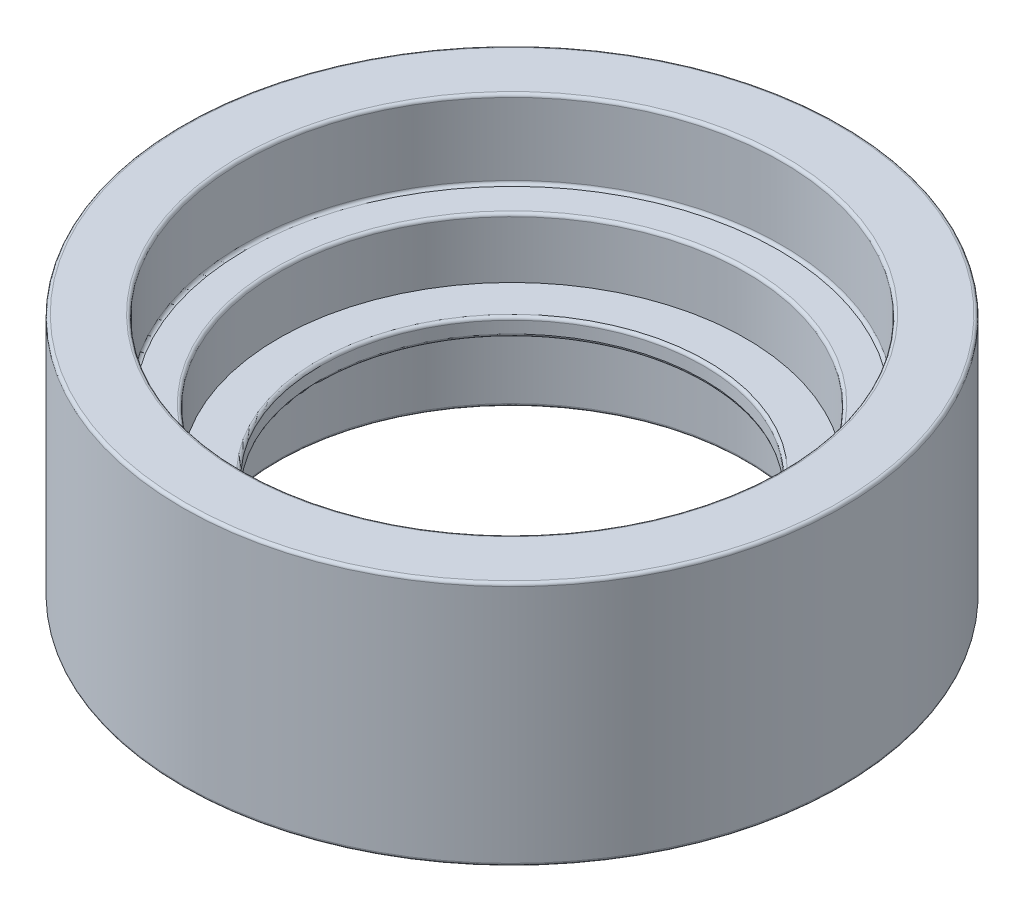
ISO-10303-21;
HEADER;
FILE_DESCRIPTION(('STEP AP214'),'2;1');
FILE_NAME('part.step','',(''),(''),'','','');
FILE_SCHEMA(('AUTOMOTIVE_DESIGN { 1 0 10303 214 1 1 1 1 }'));
ENDSEC;
DATA;
#1=APPLICATION_CONTEXT('core data for automotive mechanical design processes');
#2=APPLICATION_PROTOCOL_DEFINITION('international standard','automotive_design',2000,#1);
#3=PRODUCT_CONTEXT('',#1,'mechanical');
#4=PRODUCT('Part','Part','',(#3));
#5=PRODUCT_RELATED_PRODUCT_CATEGORY('part','',(#4));
#6=PRODUCT_DEFINITION_FORMATION('','',#4);
#7=PRODUCT_DEFINITION_CONTEXT('part definition',#1,'design');
#8=PRODUCT_DEFINITION('design','',#6,#7);
#9=PRODUCT_DEFINITION_SHAPE('','',#8);
#10=(LENGTH_UNIT() NAMED_UNIT(*) SI_UNIT(.MILLI.,.METRE.));
#11=(NAMED_UNIT(*) PLANE_ANGLE_UNIT() SI_UNIT($,.RADIAN.));
#12=(NAMED_UNIT(*) SI_UNIT($,.STERADIAN.) SOLID_ANGLE_UNIT());
#13=UNCERTAINTY_MEASURE_WITH_UNIT(LENGTH_MEASURE(1.E-05),#10,'distance_accuracy_value','');
#14=(GEOMETRIC_REPRESENTATION_CONTEXT(3) GLOBAL_UNCERTAINTY_ASSIGNED_CONTEXT((#13)) GLOBAL_UNIT_ASSIGNED_CONTEXT((#10,
#11,#12)) REPRESENTATION_CONTEXT('',''));
#15=CARTESIAN_POINT('',(0.,0.,0.));
#16=DIRECTION('',(0.,0.,1.));
#17=DIRECTION('',(1.,0.,0.));
#18=AXIS2_PLACEMENT_3D('',#15,#16,#17);
#19=CARTESIAN_POINT('',(0.,-1.5,0.));
#20=DIRECTION('',(0.,1.,0.));
#21=DIRECTION('',(0.,0.,1.));
#22=AXIS2_PLACEMENT_3D('',#19,#20,#21);
#23=CYLINDRICAL_SURFACE('',#22,32.);
#24=CARTESIAN_POINT('',(0.,-1.,0.));
#25=DIRECTION('',(0.,1.,0.));
#26=DIRECTION('',(0.,0.,1.));
#27=AXIS2_PLACEMENT_3D('',#24,#25,#26);
#28=CIRCLE('',#27,32.);
#29=CARTESIAN_POINT('',(0.,-1.,32.));
#30=VERTEX_POINT('',#29);
#31=EDGE_CURVE('E43',#30,#30,#28,.F.);
#32=ORIENTED_EDGE('',*,*,#31,.T.);
#33=EDGE_LOOP('',(#32));
#34=FACE_BOUND('',#33,.T.);
#35=CARTESIAN_POINT('',(0.,1.,0.));
#36=DIRECTION('',(0.,1.,0.));
#37=DIRECTION('',(0.,0.,1.));
#38=AXIS2_PLACEMENT_3D('',#35,#36,#37);
#39=CIRCLE('',#38,32.);
#40=CARTESIAN_POINT('',(0.,1.,32.));
#41=VERTEX_POINT('',#40);
#42=EDGE_CURVE('E47',#41,#41,#39,.T.);
#43=ORIENTED_EDGE('',*,*,#42,.T.);
#44=EDGE_LOOP('',(#43));
#45=FACE_BOUND('',#44,.T.);
#46=ADVANCED_FACE('F36',(#34,#45),#23,.F.);
#47=CARTESIAN_POINT('',(0.,-1.5,0.));
#48=DIRECTION('',(0.,1.,0.));
#49=DIRECTION('',(0.,0.,1.));
#50=AXIS2_PLACEMENT_3D('',#47,#48,#49);
#51=PLANE('',#50);
#52=CARTESIAN_POINT('',(0.,-1.5,0.));
#53=DIRECTION('',(0.,1.,0.));
#54=DIRECTION('',(0.,0.,1.));
#55=AXIS2_PLACEMENT_3D('',#52,#53,#54);
#56=CIRCLE('',#55,32.5);
#57=CARTESIAN_POINT('',(0.,-1.5,32.5));
#58=VERTEX_POINT('',#57);
#59=EDGE_CURVE('E51',#58,#58,#56,.T.);
#60=ORIENTED_EDGE('',*,*,#59,.T.);
#61=EDGE_LOOP('',(#60));
#62=FACE_BOUND('',#61,.T.);
#63=CARTESIAN_POINT('',(0.,-1.5,0.));
#64=DIRECTION('',(0.,1.,0.));
#65=DIRECTION('',(0.,0.,1.));
#66=AXIS2_PLACEMENT_3D('',#63,#64,#65);
#67=CIRCLE('',#66,39.);
#68=CARTESIAN_POINT('',(0.,-1.5,39.));
#69=VERTEX_POINT('',#68);
#70=EDGE_CURVE('E140',#69,#69,#67,.T.);
#71=ORIENTED_EDGE('',*,*,#70,.F.);
#72=EDGE_LOOP('',(#71));
#73=FACE_BOUND('',#72,.T.);
#74=ADVANCED_FACE('F188',(#62,#73),#51,.F.);
#75=CARTESIAN_POINT('',(0.,1.5,0.));
#76=DIRECTION('',(0.,1.,0.));
#77=DIRECTION('',(0.,0.,1.));
#78=AXIS2_PLACEMENT_3D('',#75,#76,#77);
#79=PLANE('',#78);
#80=CARTESIAN_POINT('',(0.,1.5,0.));
#81=DIRECTION('',(0.,1.,0.));
#82=DIRECTION('',(0.,0.,1.));
#83=AXIS2_PLACEMENT_3D('',#80,#81,#82);
#84=CIRCLE('',#83,32.5);
#85=CARTESIAN_POINT('',(0.,1.5,32.5));
#86=VERTEX_POINT('',#85);
#87=EDGE_CURVE('E10',#86,#86,#84,.F.);
#88=ORIENTED_EDGE('',*,*,#87,.T.);
#89=EDGE_LOOP('',(#88));
#90=FACE_BOUND('',#89,.T.);
#91=CARTESIAN_POINT('',(0.,1.5,0.));
#92=DIRECTION('',(0.,1.,0.));
#93=DIRECTION('',(0.,0.,1.));
#94=AXIS2_PLACEMENT_3D('',#91,#92,#93);
#95=CIRCLE('',#94,39.);
#96=CARTESIAN_POINT('',(0.,1.5,39.));
#97=VERTEX_POINT('',#96);
#98=EDGE_CURVE('E143',#97,#97,#95,.T.);
#99=ORIENTED_EDGE('',*,*,#98,.T.);
#100=EDGE_LOOP('',(#99));
#101=FACE_BOUND('',#100,.T.);
#102=ADVANCED_FACE('F193',(#90,#101),#79,.T.);
#103=CARTESIAN_POINT('',(0.,-16.5,0.));
#104=DIRECTION('',(0.,1.,0.));
#105=DIRECTION('',(0.,0.,1.));
#106=AXIS2_PLACEMENT_3D('',#103,#104,#105);
#107=CYLINDRICAL_SURFACE('',#106,39.);
#108=CARTESIAN_POINT('',(0.,-16.,0.));
#109=DIRECTION('',(0.,1.,0.));
#110=DIRECTION('',(0.,0.,1.));
#111=AXIS2_PLACEMENT_3D('',#108,#109,#110);
#112=CIRCLE('',#111,39.);
#113=CARTESIAN_POINT('',(0.,-16.,39.));
#114=VERTEX_POINT('',#113);
#115=EDGE_CURVE('E101',#114,#114,#112,.F.);
#116=ORIENTED_EDGE('',*,*,#115,.T.);
#117=EDGE_LOOP('',(#116));
#118=FACE_BOUND('',#117,.T.);
#119=ORIENTED_EDGE('',*,*,#70,.T.);
#120=EDGE_LOOP('',(#119));
#121=FACE_BOUND('',#120,.T.);
#122=ADVANCED_FACE('F265',(#118,#121),#107,.F.);
#123=CARTESIAN_POINT('',(0.,11.,0.));
#124=DIRECTION('',(0.,1.,0.));
#125=DIRECTION('',(0.,0.,1.));
#126=AXIS2_PLACEMENT_3D('',#123,#124,#125);
#127=CIRCLE('',#126,39.);
#128=CARTESIAN_POINT('',(0.,11.,39.));
#129=VERTEX_POINT('',#128);
#130=EDGE_CURVE('E62',#129,#129,#127,.T.);
#131=ORIENTED_EDGE('',*,*,#130,.T.);
#132=EDGE_LOOP('',(#131));
#133=FACE_BOUND('',#132,.T.);
#134=ORIENTED_EDGE('',*,*,#98,.F.);
#135=EDGE_LOOP('',(#134));
#136=FACE_BOUND('',#135,.T.);
#137=ADVANCED_FACE('F267',(#133,#136),#107,.F.);
#138=CARTESIAN_POINT('',(0.,-16.5,0.));
#139=DIRECTION('',(0.,1.,0.));
#140=DIRECTION('',(0.,0.,1.));
#141=AXIS2_PLACEMENT_3D('',#138,#139,#140);
#142=PLANE('',#141);
#143=CARTESIAN_POINT('',(0.,-16.5,0.));
#144=DIRECTION('',(0.,1.,0.));
#145=DIRECTION('',(0.,0.,1.));
#146=AXIS2_PLACEMENT_3D('',#143,#144,#145);
#147=CIRCLE('',#146,54.5);
#148=CARTESIAN_POINT('',(0.,-16.5,54.5));
#149=VERTEX_POINT('',#148);
#150=EDGE_CURVE('E104',#149,#149,#147,.F.);
#151=ORIENTED_EDGE('',*,*,#150,.T.);
#152=EDGE_LOOP('',(#151));
#153=FACE_BOUND('',#152,.T.);
#154=CARTESIAN_POINT('',(0.,-16.5,0.));
#155=DIRECTION('',(0.,1.,0.));
#156=DIRECTION('',(0.,0.,1.));
#157=AXIS2_PLACEMENT_3D('',#154,#155,#156);
#158=CIRCLE('',#157,39.5);
#159=CARTESIAN_POINT('',(0.,-16.5,39.5));
#160=VERTEX_POINT('',#159);
#161=EDGE_CURVE('E107',#160,#160,#158,.T.);
#162=ORIENTED_EDGE('',*,*,#161,.T.);
#163=EDGE_LOOP('',(#162));
#164=FACE_BOUND('',#163,.T.);
#165=CARTESIAN_POINT('',(-33.2340187157672,-16.5,33.2340187157663));
#166=DIRECTION('',(0.,1.,0.));
#167=DIRECTION('',(0.,0.,1.));
#168=AXIS2_PLACEMENT_3D('',#165,#166,#167);
#169=CIRCLE('',#168,2.50000000000153);
#170=CARTESIAN_POINT('',(-33.2340187157672,-16.5,35.7340187157678));
#171=VERTEX_POINT('',#170);
#172=EDGE_CURVE('E110',#171,#171,#169,.T.);
#173=ORIENTED_EDGE('',*,*,#172,.T.);
#174=EDGE_LOOP('',(#173));
#175=FACE_BOUND('',#174,.T.);
#176=CARTESIAN_POINT('',(-46.999999999998,-16.5,-2.00373051484348E-12));
#177=DIRECTION('',(0.,1.,0.));
#178=DIRECTION('',(0.,0.,1.));
#179=AXIS2_PLACEMENT_3D('',#176,#177,#178);
#180=CIRCLE('',#179,2.50000000000297);
#181=CARTESIAN_POINT('',(-46.999999999998,-16.5,2.50000000000097));
#182=VERTEX_POINT('',#181);
#183=EDGE_CURVE('E113',#182,#182,#180,.T.);
#184=ORIENTED_EDGE('',*,*,#183,.T.);
#185=EDGE_LOOP('',(#184));
#186=FACE_BOUND('',#185,.T.);
#187=CARTESIAN_POINT('',(-33.2340187157643,-16.5,-33.2340187157691));
#188=DIRECTION('',(0.,1.,0.));
#189=DIRECTION('',(0.,0.,1.));
#190=AXIS2_PLACEMENT_3D('',#187,#188,#189);
#191=CIRCLE('',#190,2.50000000000406);
#192=CARTESIAN_POINT('',(-33.2340187157643,-16.5,-30.7340187157651));
#193=VERTEX_POINT('',#192);
#194=EDGE_CURVE('E116',#193,#193,#191,.T.);
#195=ORIENTED_EDGE('',*,*,#194,.T.);
#196=EDGE_LOOP('',(#195));
#197=FACE_BOUND('',#196,.T.);
#198=CARTESIAN_POINT('',(3.99594934977498E-12,-16.5,-47.));
#199=DIRECTION('',(0.,1.,0.));
#200=DIRECTION('',(0.,0.,1.));
#201=AXIS2_PLACEMENT_3D('',#198,#199,#200);
#202=CIRCLE('',#201,2.50000000000414);
#203=CARTESIAN_POINT('',(3.99594934977498E-12,-16.5,-44.4999999999959));
#204=VERTEX_POINT('',#203);
#205=EDGE_CURVE('E119',#204,#204,#202,.T.);
#206=ORIENTED_EDGE('',*,*,#205,.T.);
#207=EDGE_LOOP('',(#206));
#208=FACE_BOUND('',#207,.T.);
#209=CARTESIAN_POINT('',(33.2340187157711,-16.5,-33.2340187157663));
#210=DIRECTION('',(0.,1.,0.));
#211=DIRECTION('',(0.,0.,1.));
#212=AXIS2_PLACEMENT_3D('',#209,#210,#211);
#213=CIRCLE('',#212,2.50000000000307);
#214=CARTESIAN_POINT('',(33.2340187157711,-16.5,-30.7340187157632));
#215=VERTEX_POINT('',#214);
#216=EDGE_CURVE('E122',#215,#215,#213,.T.);
#217=ORIENTED_EDGE('',*,*,#216,.T.);
#218=EDGE_LOOP('',(#217));
#219=FACE_BOUND('',#218,.T.);
#220=CARTESIAN_POINT('',(47.000000000002,-16.5,1.99797467488749E-12));
#221=DIRECTION('',(0.,1.,0.));
#222=DIRECTION('',(0.,0.,1.));
#223=AXIS2_PLACEMENT_3D('',#220,#221,#222);
#224=CIRCLE('',#223,2.50000000000148);
#225=CARTESIAN_POINT('',(47.000000000002,-16.5,2.50000000000348));
#226=VERTEX_POINT('',#225);
#227=EDGE_CURVE('E125',#226,#226,#224,.T.);
#228=ORIENTED_EDGE('',*,*,#227,.T.);
#229=EDGE_LOOP('',(#228));
#230=FACE_BOUND('',#229,.T.);
#231=CARTESIAN_POINT('',(33.2340187157683,-16.5,33.2340187157691));
#232=DIRECTION('',(0.,1.,0.));
#233=DIRECTION('',(0.,0.,1.));
#234=AXIS2_PLACEMENT_3D('',#231,#232,#233);
#235=CIRCLE('',#234,2.50000000000022);
#236=CARTESIAN_POINT('',(33.2340187157683,-16.5,35.7340187157694));
#237=VERTEX_POINT('',#236);
#238=EDGE_CURVE('E128',#237,#237,#235,.T.);
#239=ORIENTED_EDGE('',*,*,#238,.T.);
#240=EDGE_LOOP('',(#239));
#241=FACE_BOUND('',#240,.T.);
#242=CARTESIAN_POINT('',(0.,-16.5,47.));
#243=DIRECTION('',(0.,1.,0.));
#244=DIRECTION('',(0.,0.,1.));
#245=AXIS2_PLACEMENT_3D('',#242,#243,#244);
#246=CIRCLE('',#245,2.5);
#247=CARTESIAN_POINT('',(0.,-16.5,49.5));
#248=VERTEX_POINT('',#247);
#249=EDGE_CURVE('E131',#248,#248,#246,.T.);
#250=ORIENTED_EDGE('',*,*,#249,.T.);
#251=EDGE_LOOP('',(#250));
#252=FACE_BOUND('',#251,.T.);
#253=ADVANCED_FACE('F274',(#153,#164,#175,#186,#197,#208,#219,#230,#241,#252),#142,.F.);
#254=CARTESIAN_POINT('',(0.,11.5,0.));
#255=DIRECTION('',(0.,1.,0.));
#256=DIRECTION('',(0.,0.,1.));
#257=AXIS2_PLACEMENT_3D('',#254,#255,#256);
#258=PLANE('',#257);
#259=CARTESIAN_POINT('',(0.,11.5,0.));
#260=DIRECTION('',(0.,1.,0.));
#261=DIRECTION('',(0.,0.,1.));
#262=AXIS2_PLACEMENT_3D('',#259,#260,#261);
#263=CIRCLE('',#262,44.5);
#264=CARTESIAN_POINT('',(0.,11.5,44.5));
#265=VERTEX_POINT('',#264);
#266=EDGE_CURVE('E71',#265,#265,#263,.T.);
#267=ORIENTED_EDGE('',*,*,#266,.T.);
#268=EDGE_LOOP('',(#267));
#269=FACE_BOUND('',#268,.T.);
#270=CARTESIAN_POINT('',(0.,11.5,0.));
#271=DIRECTION('',(0.,1.,0.));
#272=DIRECTION('',(0.,0.,1.));
#273=AXIS2_PLACEMENT_3D('',#270,#271,#272);
#274=CIRCLE('',#273,39.5);
#275=CARTESIAN_POINT('',(0.,11.5,39.5));
#276=VERTEX_POINT('',#275);
#277=EDGE_CURVE('E74',#276,#276,#274,.F.);
#278=ORIENTED_EDGE('',*,*,#277,.T.);
#279=EDGE_LOOP('',(#278));
#280=FACE_BOUND('',#279,.T.);
#281=ADVANCED_FACE('F279',(#269,#280),#258,.T.);
#282=CARTESIAN_POINT('',(0.,-16.5,0.));
#283=DIRECTION('',(0.,1.,0.));
#284=DIRECTION('',(0.,0.,1.));
#285=AXIS2_PLACEMENT_3D('',#282,#283,#284);
#286=CYLINDRICAL_SURFACE('',#285,45.);
#287=CARTESIAN_POINT('',(0.,12.,0.));
#288=DIRECTION('',(0.,1.,0.));
#289=DIRECTION('',(0.,0.,1.));
#290=AXIS2_PLACEMENT_3D('',#287,#288,#289);
#291=CIRCLE('',#290,45.);
#292=CARTESIAN_POINT('',(0.,12.,45.));
#293=VERTEX_POINT('',#292);
#294=EDGE_CURVE('E65',#293,#293,#291,.F.);
#295=ORIENTED_EDGE('',*,*,#294,.T.);
#296=EDGE_LOOP('',(#295));
#297=FACE_BOUND('',#296,.T.);
#298=CARTESIAN_POINT('',(0.,24.,0.));
#299=DIRECTION('',(0.,1.,0.));
#300=DIRECTION('',(0.,0.,1.));
#301=AXIS2_PLACEMENT_3D('',#298,#299,#300);
#302=CIRCLE('',#301,45.);
#303=CARTESIAN_POINT('',(0.,24.,45.));
#304=VERTEX_POINT('',#303);
#305=EDGE_CURVE('E68',#304,#304,#302,.T.);
#306=ORIENTED_EDGE('',*,*,#305,.T.);
#307=EDGE_LOOP('',(#306));
#308=FACE_BOUND('',#307,.T.);
#309=ADVANCED_FACE('F283',(#297,#308),#286,.F.);
#310=CARTESIAN_POINT('',(0.,-16.5,0.));
#311=DIRECTION('',(0.,1.,0.));
#312=DIRECTION('',(0.,0.,1.));
#313=AXIS2_PLACEMENT_3D('',#310,#311,#312);
#314=CYLINDRICAL_SURFACE('',#313,55.);
#315=CARTESIAN_POINT('',(0.,-16.,0.));
#316=DIRECTION('',(0.,1.,0.));
#317=DIRECTION('',(0.,0.,1.));
#318=AXIS2_PLACEMENT_3D('',#315,#316,#317);
#319=CIRCLE('',#318,55.);
#320=CARTESIAN_POINT('',(0.,-16.,55.));
#321=VERTEX_POINT('',#320);
#322=EDGE_CURVE('E134',#321,#321,#319,.T.);
#323=ORIENTED_EDGE('',*,*,#322,.T.);
#324=EDGE_LOOP('',(#323));
#325=FACE_BOUND('',#324,.T.);
#326=CARTESIAN_POINT('',(0.,24.,0.));
#327=DIRECTION('',(0.,1.,0.));
#328=DIRECTION('',(0.,0.,1.));
#329=AXIS2_PLACEMENT_3D('',#326,#327,#328);
#330=CIRCLE('',#329,55.);
#331=CARTESIAN_POINT('',(0.,24.,55.));
#332=VERTEX_POINT('',#331);
#333=EDGE_CURVE('E137',#332,#332,#330,.F.);
#334=ORIENTED_EDGE('',*,*,#333,.T.);
#335=EDGE_LOOP('',(#334));
#336=FACE_BOUND('',#335,.T.);
#337=ADVANCED_FACE('F287',(#325,#336),#314,.T.);
#338=CARTESIAN_POINT('',(0.,24.5,0.));
#339=DIRECTION('',(0.,1.,0.));
#340=DIRECTION('',(0.,0.,1.));
#341=AXIS2_PLACEMENT_3D('',#338,#339,#340);
#342=PLANE('',#341);
#343=CARTESIAN_POINT('',(0.,24.5,0.));
#344=DIRECTION('',(0.,1.,0.));
#345=DIRECTION('',(0.,0.,1.));
#346=AXIS2_PLACEMENT_3D('',#343,#344,#345);
#347=CIRCLE('',#346,54.5);
#348=CARTESIAN_POINT('',(0.,24.5,54.5));
#349=VERTEX_POINT('',#348);
#350=EDGE_CURVE('E56',#349,#349,#347,.T.);
#351=ORIENTED_EDGE('',*,*,#350,.T.);
#352=EDGE_LOOP('',(#351));
#353=FACE_BOUND('',#352,.T.);
#354=CARTESIAN_POINT('',(0.,24.5,0.));
#355=DIRECTION('',(0.,1.,0.));
#356=DIRECTION('',(0.,0.,1.));
#357=AXIS2_PLACEMENT_3D('',#354,#355,#356);
#358=CIRCLE('',#357,45.5);
#359=CARTESIAN_POINT('',(0.,24.5,45.5));
#360=VERTEX_POINT('',#359);
#361=EDGE_CURVE('E59',#360,#360,#358,.F.);
#362=ORIENTED_EDGE('',*,*,#361,.T.);
#363=EDGE_LOOP('',(#362));
#364=FACE_BOUND('',#363,.T.);
#365=ADVANCED_FACE('F291',(#353,#364),#342,.T.);
#366=CARTESIAN_POINT('',(-33.2340187157672,-6.5,33.2340187157663));
#367=DIRECTION('',(0.,-1.,0.));
#368=DIRECTION('',(0.,0.,-1.));
#369=AXIS2_PLACEMENT_3D('',#366,#367,#368);
#370=CYLINDRICAL_SURFACE('',#369,2.00000000000153);
#371=CARTESIAN_POINT('',(-33.2340187157672,-16.,33.2340187157663));
#372=DIRECTION('',(0.,1.,0.));
#373=DIRECTION('',(0.,0.,1.));
#374=AXIS2_PLACEMENT_3D('',#371,#372,#373);
#375=CIRCLE('',#374,2.00000000000153);
#376=CARTESIAN_POINT('',(-33.2340187157672,-16.,35.2340187157678));
#377=VERTEX_POINT('',#376);
#378=EDGE_CURVE('E98',#377,#377,#375,.F.);
#379=ORIENTED_EDGE('',*,*,#378,.T.);
#380=EDGE_LOOP('',(#379));
#381=FACE_BOUND('',#380,.T.);
#382=CARTESIAN_POINT('',(-33.2340187157672,-6.5,33.2340187157663));
#383=DIRECTION('',(0.,-1.,0.));
#384=DIRECTION('',(0.,0.,-1.));
#385=AXIS2_PLACEMENT_3D('',#382,#383,#384);
#386=CIRCLE('',#385,2.00000000000153);
#387=CARTESIAN_POINT('',(-33.2340187157672,-6.5,31.2340187157648));
#388=VERTEX_POINT('',#387);
#389=EDGE_CURVE('E147',#388,#388,#386,.T.);
#390=ORIENTED_EDGE('',*,*,#389,.F.);
#391=EDGE_LOOP('',(#390));
#392=FACE_BOUND('',#391,.T.);
#393=ADVANCED_FACE('F295',(#381,#392),#370,.F.);
#394=CARTESIAN_POINT('',(-33.2340187157672,-6.5,33.2340187157663));
#395=DIRECTION('',(0.,-1.,0.));
#396=DIRECTION('',(0.,0.,-1.));
#397=AXIS2_PLACEMENT_3D('',#394,#395,#396);
#398=PLANE('',#397);
#399=ORIENTED_EDGE('',*,*,#389,.T.);
#400=EDGE_LOOP('',(#399));
#401=FACE_BOUND('',#400,.T.);
#402=ADVANCED_FACE('F299',(#401),#398,.T.);
#403=CARTESIAN_POINT('',(-46.999999999998,-6.5,-2.00373051484348E-12));
#404=DIRECTION('',(0.,-1.,0.));
#405=DIRECTION('',(0.,0.,-1.));
#406=AXIS2_PLACEMENT_3D('',#403,#404,#405);
#407=CYLINDRICAL_SURFACE('',#406,2.00000000000297);
#408=CARTESIAN_POINT('',(-46.999999999998,-16.,-2.00373051484348E-12));
#409=DIRECTION('',(0.,1.,0.));
#410=DIRECTION('',(0.,0.,1.));
#411=AXIS2_PLACEMENT_3D('',#408,#409,#410);
#412=CIRCLE('',#411,2.00000000000297);
#413=CARTESIAN_POINT('',(-46.999999999998,-16.,2.00000000000097));
#414=VERTEX_POINT('',#413);
#415=EDGE_CURVE('E95',#414,#414,#412,.F.);
#416=ORIENTED_EDGE('',*,*,#415,.T.);
#417=EDGE_LOOP('',(#416));
#418=FACE_BOUND('',#417,.T.);
#419=CARTESIAN_POINT('',(-46.999999999998,-6.5,-2.00373051484348E-12));
#420=DIRECTION('',(0.,-1.,0.));
#421=DIRECTION('',(0.,0.,-1.));
#422=AXIS2_PLACEMENT_3D('',#419,#420,#421);
#423=CIRCLE('',#422,2.00000000000297);
#424=CARTESIAN_POINT('',(-46.999999999998,-6.5,-2.00000000000498));
#425=VERTEX_POINT('',#424);
#426=EDGE_CURVE('E150',#425,#425,#423,.T.);
#427=ORIENTED_EDGE('',*,*,#426,.F.);
#428=EDGE_LOOP('',(#427));
#429=FACE_BOUND('',#428,.T.);
#430=ADVANCED_FACE('F303',(#418,#429),#407,.F.);
#431=CARTESIAN_POINT('',(-46.999999999998,-6.5,-2.00373051484348E-12));
#432=DIRECTION('',(0.,-1.,0.));
#433=DIRECTION('',(0.,0.,-1.));
#434=AXIS2_PLACEMENT_3D('',#431,#432,#433);
#435=PLANE('',#434);
#436=ORIENTED_EDGE('',*,*,#426,.T.);
#437=EDGE_LOOP('',(#436));
#438=FACE_BOUND('',#437,.T.);
#439=ADVANCED_FACE('F307',(#438),#435,.T.);
#440=CARTESIAN_POINT('',(-33.2340187157643,-6.5,-33.2340187157691));
#441=DIRECTION('',(0.,-1.,0.));
#442=DIRECTION('',(0.,0.,-1.));
#443=AXIS2_PLACEMENT_3D('',#440,#441,#442);
#444=CYLINDRICAL_SURFACE('',#443,2.00000000000406);
#445=CARTESIAN_POINT('',(-33.2340187157643,-16.,-33.2340187157691));
#446=DIRECTION('',(0.,1.,0.));
#447=DIRECTION('',(0.,0.,1.));
#448=AXIS2_PLACEMENT_3D('',#445,#446,#447);
#449=CIRCLE('',#448,2.00000000000406);
#450=CARTESIAN_POINT('',(-33.2340187157643,-16.,-31.2340187157651));
#451=VERTEX_POINT('',#450);
#452=EDGE_CURVE('E92',#451,#451,#449,.F.);
#453=ORIENTED_EDGE('',*,*,#452,.T.);
#454=EDGE_LOOP('',(#453));
#455=FACE_BOUND('',#454,.T.);
#456=CARTESIAN_POINT('',(-33.2340187157643,-6.5,-33.2340187157691));
#457=DIRECTION('',(0.,-1.,0.));
#458=DIRECTION('',(0.,0.,-1.));
#459=AXIS2_PLACEMENT_3D('',#456,#457,#458);
#460=CIRCLE('',#459,2.00000000000406);
#461=CARTESIAN_POINT('',(-33.2340187157643,-6.5,-35.2340187157732));
#462=VERTEX_POINT('',#461);
#463=EDGE_CURVE('E153',#462,#462,#460,.T.);
#464=ORIENTED_EDGE('',*,*,#463,.F.);
#465=EDGE_LOOP('',(#464));
#466=FACE_BOUND('',#465,.T.);
#467=ADVANCED_FACE('F311',(#455,#466),#444,.F.);
#468=CARTESIAN_POINT('',(-33.2340187157643,-6.5,-33.2340187157691));
#469=DIRECTION('',(0.,-1.,0.));
#470=DIRECTION('',(0.,0.,-1.));
#471=AXIS2_PLACEMENT_3D('',#468,#469,#470);
#472=PLANE('',#471);
#473=ORIENTED_EDGE('',*,*,#463,.T.);
#474=EDGE_LOOP('',(#473));
#475=FACE_BOUND('',#474,.T.);
#476=ADVANCED_FACE('F315',(#475),#472,.T.);
#477=CARTESIAN_POINT('',(3.99594934977498E-12,-6.5,-47.));
#478=DIRECTION('',(0.,-1.,0.));
#479=DIRECTION('',(0.,0.,-1.));
#480=AXIS2_PLACEMENT_3D('',#477,#478,#479);
#481=CYLINDRICAL_SURFACE('',#480,2.00000000000414);
#482=CARTESIAN_POINT('',(3.99594934977498E-12,-16.,-47.));
#483=DIRECTION('',(0.,1.,0.));
#484=DIRECTION('',(0.,0.,1.));
#485=AXIS2_PLACEMENT_3D('',#482,#483,#484);
#486=CIRCLE('',#485,2.00000000000414);
#487=CARTESIAN_POINT('',(3.99594934977498E-12,-16.,-44.9999999999959));
#488=VERTEX_POINT('',#487);
#489=EDGE_CURVE('E89',#488,#488,#486,.F.);
#490=ORIENTED_EDGE('',*,*,#489,.T.);
#491=EDGE_LOOP('',(#490));
#492=FACE_BOUND('',#491,.T.);
#493=CARTESIAN_POINT('',(3.99594934977498E-12,-6.5,-47.));
#494=DIRECTION('',(0.,-1.,0.));
#495=DIRECTION('',(0.,0.,-1.));
#496=AXIS2_PLACEMENT_3D('',#493,#494,#495);
#497=CIRCLE('',#496,2.00000000000414);
#498=CARTESIAN_POINT('',(3.99594934977498E-12,-6.5,-49.0000000000041));
#499=VERTEX_POINT('',#498);
#500=EDGE_CURVE('E156',#499,#499,#497,.T.);
#501=ORIENTED_EDGE('',*,*,#500,.F.);
#502=EDGE_LOOP('',(#501));
#503=FACE_BOUND('',#502,.T.);
#504=ADVANCED_FACE('F319',(#492,#503),#481,.F.);
#505=CARTESIAN_POINT('',(3.99594934977498E-12,-6.5,-47.));
#506=DIRECTION('',(0.,-1.,0.));
#507=DIRECTION('',(0.,0.,-1.));
#508=AXIS2_PLACEMENT_3D('',#505,#506,#507);
#509=PLANE('',#508);
#510=ORIENTED_EDGE('',*,*,#500,.T.);
#511=EDGE_LOOP('',(#510));
#512=FACE_BOUND('',#511,.T.);
#513=ADVANCED_FACE('F323',(#512),#509,.T.);
#514=CARTESIAN_POINT('',(33.2340187157711,-6.5,-33.2340187157663));
#515=DIRECTION('',(0.,-1.,0.));
#516=DIRECTION('',(0.,0.,-1.));
#517=AXIS2_PLACEMENT_3D('',#514,#515,#516);
#518=CYLINDRICAL_SURFACE('',#517,2.00000000000307);
#519=CARTESIAN_POINT('',(33.2340187157711,-16.,-33.2340187157663));
#520=DIRECTION('',(0.,1.,0.));
#521=DIRECTION('',(0.,0.,1.));
#522=AXIS2_PLACEMENT_3D('',#519,#520,#521);
#523=CIRCLE('',#522,2.00000000000307);
#524=CARTESIAN_POINT('',(33.2340187157711,-16.,-31.2340187157632));
#525=VERTEX_POINT('',#524);
#526=EDGE_CURVE('E86',#525,#525,#523,.F.);
#527=ORIENTED_EDGE('',*,*,#526,.T.);
#528=EDGE_LOOP('',(#527));
#529=FACE_BOUND('',#528,.T.);
#530=CARTESIAN_POINT('',(33.2340187157711,-6.5,-33.2340187157663));
#531=DIRECTION('',(0.,-1.,0.));
#532=DIRECTION('',(0.,0.,-1.));
#533=AXIS2_PLACEMENT_3D('',#530,#531,#532);
#534=CIRCLE('',#533,2.00000000000307);
#535=CARTESIAN_POINT('',(33.2340187157711,-6.5,-35.2340187157694));
#536=VERTEX_POINT('',#535);
#537=EDGE_CURVE('E159',#536,#536,#534,.T.);
#538=ORIENTED_EDGE('',*,*,#537,.F.);
#539=EDGE_LOOP('',(#538));
#540=FACE_BOUND('',#539,.T.);
#541=ADVANCED_FACE('F327',(#529,#540),#518,.F.);
#542=CARTESIAN_POINT('',(33.2340187157711,-6.5,-33.2340187157663));
#543=DIRECTION('',(0.,-1.,0.));
#544=DIRECTION('',(0.,0.,-1.));
#545=AXIS2_PLACEMENT_3D('',#542,#543,#544);
#546=PLANE('',#545);
#547=ORIENTED_EDGE('',*,*,#537,.T.);
#548=EDGE_LOOP('',(#547));
#549=FACE_BOUND('',#548,.T.);
#550=ADVANCED_FACE('F331',(#549),#546,.T.);
#551=CARTESIAN_POINT('',(47.000000000002,-6.5,1.99797467488749E-12));
#552=DIRECTION('',(0.,-1.,0.));
#553=DIRECTION('',(0.,0.,-1.));
#554=AXIS2_PLACEMENT_3D('',#551,#552,#553);
#555=CYLINDRICAL_SURFACE('',#554,2.00000000000148);
#556=CARTESIAN_POINT('',(47.000000000002,-16.,1.99797467488749E-12));
#557=DIRECTION('',(0.,1.,0.));
#558=DIRECTION('',(0.,0.,1.));
#559=AXIS2_PLACEMENT_3D('',#556,#557,#558);
#560=CIRCLE('',#559,2.00000000000148);
#561=CARTESIAN_POINT('',(47.000000000002,-16.,2.00000000000348));
#562=VERTEX_POINT('',#561);
#563=EDGE_CURVE('E83',#562,#562,#560,.F.);
#564=ORIENTED_EDGE('',*,*,#563,.T.);
#565=EDGE_LOOP('',(#564));
#566=FACE_BOUND('',#565,.T.);
#567=CARTESIAN_POINT('',(47.000000000002,-6.5,1.99797467488749E-12));
#568=DIRECTION('',(0.,-1.,0.));
#569=DIRECTION('',(0.,0.,-1.));
#570=AXIS2_PLACEMENT_3D('',#567,#568,#569);
#571=CIRCLE('',#570,2.00000000000148);
#572=CARTESIAN_POINT('',(47.000000000002,-6.5,-1.99999999999948));
#573=VERTEX_POINT('',#572);
#574=EDGE_CURVE('E162',#573,#573,#571,.T.);
#575=ORIENTED_EDGE('',*,*,#574,.F.);
#576=EDGE_LOOP('',(#575));
#577=FACE_BOUND('',#576,.T.);
#578=ADVANCED_FACE('F335',(#566,#577),#555,.F.);
#579=CARTESIAN_POINT('',(47.000000000002,-6.5,1.99797467488749E-12));
#580=DIRECTION('',(0.,-1.,0.));
#581=DIRECTION('',(0.,0.,-1.));
#582=AXIS2_PLACEMENT_3D('',#579,#580,#581);
#583=PLANE('',#582);
#584=ORIENTED_EDGE('',*,*,#574,.T.);
#585=EDGE_LOOP('',(#584));
#586=FACE_BOUND('',#585,.T.);
#587=ADVANCED_FACE('F339',(#586),#583,.T.);
#588=CARTESIAN_POINT('',(33.2340187157683,-6.5,33.2340187157691));
#589=DIRECTION('',(0.,-1.,0.));
#590=DIRECTION('',(0.,0.,-1.));
#591=AXIS2_PLACEMENT_3D('',#588,#589,#590);
#592=CYLINDRICAL_SURFACE('',#591,2.00000000000022);
#593=CARTESIAN_POINT('',(33.2340187157683,-16.,33.2340187157691));
#594=DIRECTION('',(0.,1.,0.));
#595=DIRECTION('',(0.,0.,1.));
#596=AXIS2_PLACEMENT_3D('',#593,#594,#595);
#597=CIRCLE('',#596,2.00000000000022);
#598=CARTESIAN_POINT('',(33.2340187157683,-16.,35.2340187157694));
#599=VERTEX_POINT('',#598);
#600=EDGE_CURVE('E80',#599,#599,#597,.F.);
#601=ORIENTED_EDGE('',*,*,#600,.T.);
#602=EDGE_LOOP('',(#601));
#603=FACE_BOUND('',#602,.T.);
#604=CARTESIAN_POINT('',(33.2340187157683,-6.5,33.2340187157691));
#605=DIRECTION('',(0.,-1.,0.));
#606=DIRECTION('',(0.,0.,-1.));
#607=AXIS2_PLACEMENT_3D('',#604,#605,#606);
#608=CIRCLE('',#607,2.00000000000022);
#609=CARTESIAN_POINT('',(33.2340187157683,-6.5,31.2340187157689));
#610=VERTEX_POINT('',#609);
#611=EDGE_CURVE('E165',#610,#610,#608,.T.);
#612=ORIENTED_EDGE('',*,*,#611,.F.);
#613=EDGE_LOOP('',(#612));
#614=FACE_BOUND('',#613,.T.);
#615=ADVANCED_FACE('F184',(#603,#614),#592,.F.);
#616=CARTESIAN_POINT('',(33.2340187157683,-6.5,33.2340187157691));
#617=DIRECTION('',(0.,-1.,0.));
#618=DIRECTION('',(0.,0.,-1.));
#619=AXIS2_PLACEMENT_3D('',#616,#617,#618);
#620=PLANE('',#619);
#621=ORIENTED_EDGE('',*,*,#611,.T.);
#622=EDGE_LOOP('',(#621));
#623=FACE_BOUND('',#622,.T.);
#624=ADVANCED_FACE('F175',(#623),#620,.T.);
#625=CARTESIAN_POINT('',(0.,-6.5,47.));
#626=DIRECTION('',(0.,-1.,0.));
#627=DIRECTION('',(0.,0.,-1.));
#628=AXIS2_PLACEMENT_3D('',#625,#626,#627);
#629=CYLINDRICAL_SURFACE('',#628,2.);
#630=CARTESIAN_POINT('',(0.,-16.,47.));
#631=DIRECTION('',(0.,1.,0.));
#632=DIRECTION('',(0.,0.,1.));
#633=AXIS2_PLACEMENT_3D('',#630,#631,#632);
#634=CIRCLE('',#633,2.);
#635=CARTESIAN_POINT('',(0.,-16.,49.));
#636=VERTEX_POINT('',#635);
#637=EDGE_CURVE('E77',#636,#636,#634,.F.);
#638=ORIENTED_EDGE('',*,*,#637,.T.);
#639=EDGE_LOOP('',(#638));
#640=FACE_BOUND('',#639,.T.);
#641=CARTESIAN_POINT('',(0.,-6.5,47.));
#642=DIRECTION('',(0.,-1.,0.));
#643=DIRECTION('',(0.,0.,-1.));
#644=AXIS2_PLACEMENT_3D('',#641,#642,#643);
#645=CIRCLE('',#644,2.);
#646=CARTESIAN_POINT('',(0.,-6.5,45.));
#647=VERTEX_POINT('',#646);
#648=EDGE_CURVE('E146',#647,#647,#645,.T.);
#649=ORIENTED_EDGE('',*,*,#648,.F.);
#650=EDGE_LOOP('',(#649));
#651=FACE_BOUND('',#650,.T.);
#652=ADVANCED_FACE('F173',(#640,#651),#629,.F.);
#653=CARTESIAN_POINT('',(0.,-6.5,47.));
#654=DIRECTION('',(0.,-1.,0.));
#655=DIRECTION('',(0.,0.,-1.));
#656=AXIS2_PLACEMENT_3D('',#653,#654,#655);
#657=PLANE('',#656);
#658=ORIENTED_EDGE('',*,*,#648,.T.);
#659=EDGE_LOOP('',(#658));
#660=FACE_BOUND('',#659,.T.);
#661=ADVANCED_FACE('F171',(#660),#657,.T.);
#662=CARTESIAN_POINT('',(0.,-16.,0.));
#663=DIRECTION('',(0.,1.,0.));
#664=DIRECTION('',(0.,0.,1.));
#665=AXIS2_PLACEMENT_3D('',#662,#663,#664);
#666=TOROIDAL_SURFACE('',#665,54.5,0.5);
#667=ORIENTED_EDGE('',*,*,#150,.F.);
#668=EDGE_LOOP('',(#667));
#669=FACE_BOUND('',#668,.T.);
#670=ORIENTED_EDGE('',*,*,#322,.F.);
#671=EDGE_LOOP('',(#670));
#672=FACE_BOUND('',#671,.T.);
#673=ADVANCED_FACE('F182',(#669,#672),#666,.T.);
#674=CARTESIAN_POINT('',(0.,-16.,0.));
#675=DIRECTION('',(0.,1.,0.));
#676=DIRECTION('',(0.,0.,1.));
#677=AXIS2_PLACEMENT_3D('',#674,#675,#676);
#678=TOROIDAL_SURFACE('',#677,39.5,0.5);
#679=ORIENTED_EDGE('',*,*,#115,.F.);
#680=EDGE_LOOP('',(#679));
#681=FACE_BOUND('',#680,.T.);
#682=ORIENTED_EDGE('',*,*,#161,.F.);
#683=EDGE_LOOP('',(#682));
#684=FACE_BOUND('',#683,.T.);
#685=ADVANCED_FACE('F201',(#681,#684),#678,.T.);
#686=CARTESIAN_POINT('',(-33.2340187157672,-16.,33.2340187157663));
#687=DIRECTION('',(0.,1.,0.));
#688=DIRECTION('',(0.,0.,1.));
#689=AXIS2_PLACEMENT_3D('',#686,#687,#688);
#690=TOROIDAL_SURFACE('',#689,2.50000000000153,0.5);
#691=ORIENTED_EDGE('',*,*,#172,.F.);
#692=EDGE_LOOP('',(#691));
#693=FACE_BOUND('',#692,.T.);
#694=ORIENTED_EDGE('',*,*,#378,.F.);
#695=EDGE_LOOP('',(#694));
#696=FACE_BOUND('',#695,.T.);
#697=ADVANCED_FACE('F205',(#693,#696),#690,.T.);
#698=CARTESIAN_POINT('',(-46.999999999998,-16.,-2.00373051484348E-12));
#699=DIRECTION('',(0.,1.,0.));
#700=DIRECTION('',(0.,0.,1.));
#701=AXIS2_PLACEMENT_3D('',#698,#699,#700);
#702=TOROIDAL_SURFACE('',#701,2.50000000000297,0.5);
#703=ORIENTED_EDGE('',*,*,#183,.F.);
#704=EDGE_LOOP('',(#703));
#705=FACE_BOUND('',#704,.T.);
#706=ORIENTED_EDGE('',*,*,#415,.F.);
#707=EDGE_LOOP('',(#706));
#708=FACE_BOUND('',#707,.T.);
#709=ADVANCED_FACE('F209',(#705,#708),#702,.T.);
#710=CARTESIAN_POINT('',(-33.2340187157643,-16.,-33.2340187157691));
#711=DIRECTION('',(0.,1.,0.));
#712=DIRECTION('',(0.,0.,1.));
#713=AXIS2_PLACEMENT_3D('',#710,#711,#712);
#714=TOROIDAL_SURFACE('',#713,2.50000000000406,0.5);
#715=ORIENTED_EDGE('',*,*,#194,.F.);
#716=EDGE_LOOP('',(#715));
#717=FACE_BOUND('',#716,.T.);
#718=ORIENTED_EDGE('',*,*,#452,.F.);
#719=EDGE_LOOP('',(#718));
#720=FACE_BOUND('',#719,.T.);
#721=ADVANCED_FACE('F213',(#717,#720),#714,.T.);
#722=CARTESIAN_POINT('',(3.99594934977498E-12,-16.,-47.));
#723=DIRECTION('',(0.,1.,0.));
#724=DIRECTION('',(0.,0.,1.));
#725=AXIS2_PLACEMENT_3D('',#722,#723,#724);
#726=TOROIDAL_SURFACE('',#725,2.50000000000414,0.5);
#727=ORIENTED_EDGE('',*,*,#205,.F.);
#728=EDGE_LOOP('',(#727));
#729=FACE_BOUND('',#728,.T.);
#730=ORIENTED_EDGE('',*,*,#489,.F.);
#731=EDGE_LOOP('',(#730));
#732=FACE_BOUND('',#731,.T.);
#733=ADVANCED_FACE('F217',(#729,#732),#726,.T.);
#734=CARTESIAN_POINT('',(33.2340187157711,-16.,-33.2340187157663));
#735=DIRECTION('',(0.,1.,0.));
#736=DIRECTION('',(0.,0.,1.));
#737=AXIS2_PLACEMENT_3D('',#734,#735,#736);
#738=TOROIDAL_SURFACE('',#737,2.50000000000307,0.5);
#739=ORIENTED_EDGE('',*,*,#216,.F.);
#740=EDGE_LOOP('',(#739));
#741=FACE_BOUND('',#740,.T.);
#742=ORIENTED_EDGE('',*,*,#526,.F.);
#743=EDGE_LOOP('',(#742));
#744=FACE_BOUND('',#743,.T.);
#745=ADVANCED_FACE('F221',(#741,#744),#738,.T.);
#746=CARTESIAN_POINT('',(47.000000000002,-16.,1.99797467488749E-12));
#747=DIRECTION('',(0.,1.,0.));
#748=DIRECTION('',(0.,0.,1.));
#749=AXIS2_PLACEMENT_3D('',#746,#747,#748);
#750=TOROIDAL_SURFACE('',#749,2.50000000000148,0.5);
#751=ORIENTED_EDGE('',*,*,#227,.F.);
#752=EDGE_LOOP('',(#751));
#753=FACE_BOUND('',#752,.T.);
#754=ORIENTED_EDGE('',*,*,#563,.F.);
#755=EDGE_LOOP('',(#754));
#756=FACE_BOUND('',#755,.T.);
#757=ADVANCED_FACE('F225',(#753,#756),#750,.T.);
#758=CARTESIAN_POINT('',(33.2340187157683,-16.,33.2340187157691));
#759=DIRECTION('',(0.,1.,0.));
#760=DIRECTION('',(0.,0.,1.));
#761=AXIS2_PLACEMENT_3D('',#758,#759,#760);
#762=TOROIDAL_SURFACE('',#761,2.50000000000022,0.5);
#763=ORIENTED_EDGE('',*,*,#238,.F.);
#764=EDGE_LOOP('',(#763));
#765=FACE_BOUND('',#764,.T.);
#766=ORIENTED_EDGE('',*,*,#600,.F.);
#767=EDGE_LOOP('',(#766));
#768=FACE_BOUND('',#767,.T.);
#769=ADVANCED_FACE('F229',(#765,#768),#762,.T.);
#770=CARTESIAN_POINT('',(0.,-16.,47.));
#771=DIRECTION('',(0.,1.,0.));
#772=DIRECTION('',(0.,0.,1.));
#773=AXIS2_PLACEMENT_3D('',#770,#771,#772);
#774=TOROIDAL_SURFACE('',#773,2.5,0.5);
#775=ORIENTED_EDGE('',*,*,#249,.F.);
#776=EDGE_LOOP('',(#775));
#777=FACE_BOUND('',#776,.T.);
#778=ORIENTED_EDGE('',*,*,#637,.F.);
#779=EDGE_LOOP('',(#778));
#780=FACE_BOUND('',#779,.T.);
#781=ADVANCED_FACE('F233',(#777,#780),#774,.T.);
#782=CARTESIAN_POINT('',(0.,12.,0.));
#783=DIRECTION('',(0.,1.,0.));
#784=DIRECTION('',(0.,0.,1.));
#785=AXIS2_PLACEMENT_3D('',#782,#783,#784);
#786=TOROIDAL_SURFACE('',#785,44.5,0.5);
#787=ORIENTED_EDGE('',*,*,#294,.F.);
#788=EDGE_LOOP('',(#787));
#789=FACE_BOUND('',#788,.T.);
#790=ORIENTED_EDGE('',*,*,#266,.F.);
#791=EDGE_LOOP('',(#790));
#792=FACE_BOUND('',#791,.T.);
#793=ADVANCED_FACE('F237',(#789,#792),#786,.F.);
#794=CARTESIAN_POINT('',(0.,11.,0.));
#795=DIRECTION('',(0.,1.,0.));
#796=DIRECTION('',(0.,0.,1.));
#797=AXIS2_PLACEMENT_3D('',#794,#795,#796);
#798=TOROIDAL_SURFACE('',#797,39.5,0.5);
#799=ORIENTED_EDGE('',*,*,#277,.F.);
#800=EDGE_LOOP('',(#799));
#801=FACE_BOUND('',#800,.T.);
#802=ORIENTED_EDGE('',*,*,#130,.F.);
#803=EDGE_LOOP('',(#802));
#804=FACE_BOUND('',#803,.T.);
#805=ADVANCED_FACE('F241',(#801,#804),#798,.T.);
#806=CARTESIAN_POINT('',(0.,24.,0.));
#807=DIRECTION('',(0.,1.,0.));
#808=DIRECTION('',(0.,0.,1.));
#809=AXIS2_PLACEMENT_3D('',#806,#807,#808);
#810=TOROIDAL_SURFACE('',#809,54.5,0.5);
#811=ORIENTED_EDGE('',*,*,#333,.F.);
#812=EDGE_LOOP('',(#811));
#813=FACE_BOUND('',#812,.T.);
#814=ORIENTED_EDGE('',*,*,#350,.F.);
#815=EDGE_LOOP('',(#814));
#816=FACE_BOUND('',#815,.T.);
#817=ADVANCED_FACE('F245',(#813,#816),#810,.T.);
#818=CARTESIAN_POINT('',(0.,24.,0.));
#819=DIRECTION('',(0.,1.,0.));
#820=DIRECTION('',(0.,0.,1.));
#821=AXIS2_PLACEMENT_3D('',#818,#819,#820);
#822=TOROIDAL_SURFACE('',#821,45.5,0.5);
#823=ORIENTED_EDGE('',*,*,#361,.F.);
#824=EDGE_LOOP('',(#823));
#825=FACE_BOUND('',#824,.T.);
#826=ORIENTED_EDGE('',*,*,#305,.F.);
#827=EDGE_LOOP('',(#826));
#828=FACE_BOUND('',#827,.T.);
#829=ADVANCED_FACE('F249',(#825,#828),#822,.T.);
#830=CARTESIAN_POINT('',(0.,-1.,0.));
#831=DIRECTION('',(0.,1.,0.));
#832=DIRECTION('',(0.,0.,1.));
#833=AXIS2_PLACEMENT_3D('',#830,#831,#832);
#834=TOROIDAL_SURFACE('',#833,32.5,0.5);
#835=ORIENTED_EDGE('',*,*,#31,.F.);
#836=EDGE_LOOP('',(#835));
#837=FACE_BOUND('',#836,.T.);
#838=ORIENTED_EDGE('',*,*,#59,.F.);
#839=EDGE_LOOP('',(#838));
#840=FACE_BOUND('',#839,.T.);
#841=ADVANCED_FACE('F252',(#837,#840),#834,.T.);
#842=CARTESIAN_POINT('',(0.,1.,0.));
#843=DIRECTION('',(0.,1.,0.));
#844=DIRECTION('',(0.,0.,1.));
#845=AXIS2_PLACEMENT_3D('',#842,#843,#844);
#846=TOROIDAL_SURFACE('',#845,32.5,0.5);
#847=ORIENTED_EDGE('',*,*,#87,.F.);
#848=EDGE_LOOP('',(#847));
#849=FACE_BOUND('',#848,.T.);
#850=ORIENTED_EDGE('',*,*,#42,.F.);
#851=EDGE_LOOP('',(#850));
#852=FACE_BOUND('',#851,.T.);
#853=ADVANCED_FACE('F38',(#849,#852),#846,.T.);
#854=CLOSED_SHELL('',(#46,#74,#102,#122,#137,#253,#281,#309,#337,#365,#393,#402,#430,#439,#467,
#476,#504,#513,#541,#550,#578,#587,#615,#624,#652,#661,#673,#685,#697,#709,#721,#733,#745,#757,
#769,#781,#793,#805,#817,#829,#841,#853));
#855=MANIFOLD_SOLID_BREP('B2',#854);
#856=ADVANCED_BREP_SHAPE_REPRESENTATION('',(#18,#855),#14);
#857=SHAPE_DEFINITION_REPRESENTATION(#9,#856);
ENDSEC;
END-ISO-10303-21;
